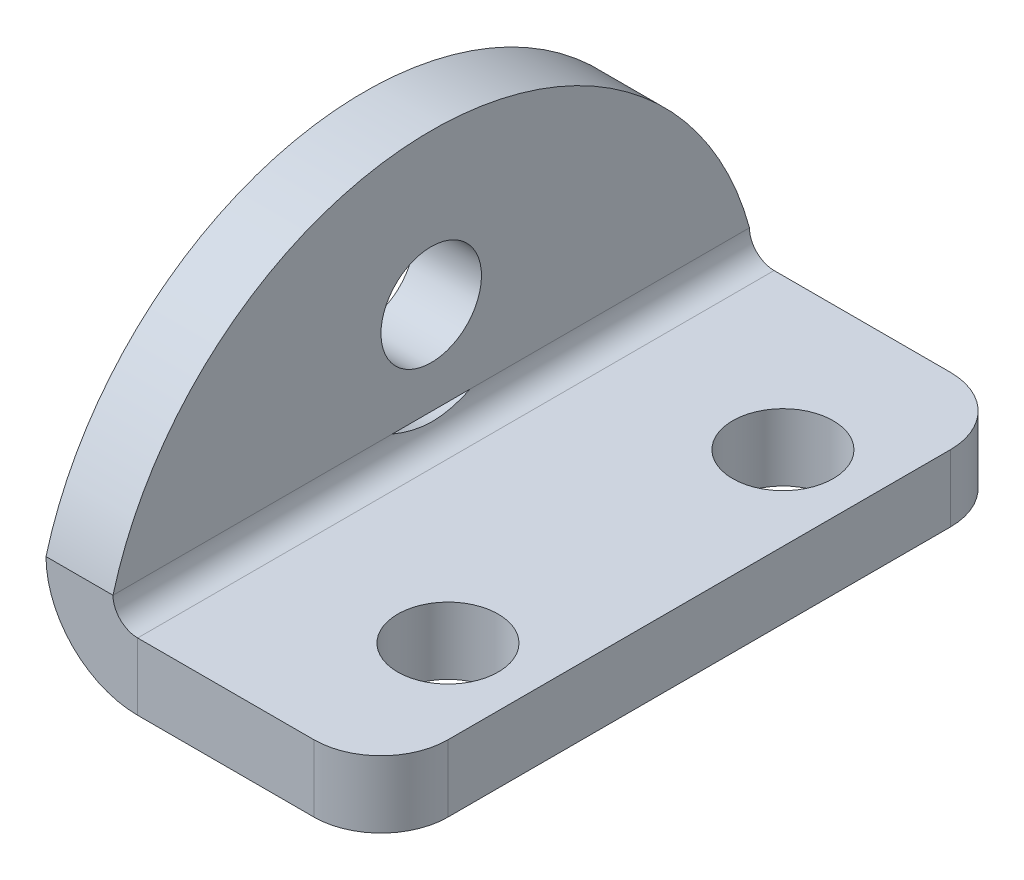
ISO-10303-21;
HEADER;
FILE_DESCRIPTION(('STEP AP214'),'2;1');
FILE_NAME('part.step','',(''),(''),'','','');
FILE_SCHEMA(('AUTOMOTIVE_DESIGN { 1 0 10303 214 1 1 1 1 }'));
ENDSEC;
DATA;
#1=APPLICATION_CONTEXT('core data for automotive mechanical design processes');
#2=APPLICATION_PROTOCOL_DEFINITION('international standard','automotive_design',2000,#1);
#3=PRODUCT_CONTEXT('',#1,'mechanical');
#4=PRODUCT('Part','Part','',(#3));
#5=PRODUCT_RELATED_PRODUCT_CATEGORY('part','',(#4));
#6=PRODUCT_DEFINITION_FORMATION('','',#4);
#7=PRODUCT_DEFINITION_CONTEXT('part definition',#1,'design');
#8=PRODUCT_DEFINITION('design','',#6,#7);
#9=PRODUCT_DEFINITION_SHAPE('','',#8);
#10=(LENGTH_UNIT() NAMED_UNIT(*) SI_UNIT(.MILLI.,.METRE.));
#11=(NAMED_UNIT(*) PLANE_ANGLE_UNIT() SI_UNIT($,.RADIAN.));
#12=(NAMED_UNIT(*) SI_UNIT($,.STERADIAN.) SOLID_ANGLE_UNIT());
#13=UNCERTAINTY_MEASURE_WITH_UNIT(LENGTH_MEASURE(1.E-05),#10,'distance_accuracy_value','');
#14=(GEOMETRIC_REPRESENTATION_CONTEXT(3) GLOBAL_UNCERTAINTY_ASSIGNED_CONTEXT((#13)) GLOBAL_UNIT_ASSIGNED_CONTEXT((#10,
#11,#12)) REPRESENTATION_CONTEXT('',''));
#15=CARTESIAN_POINT('',(0.,0.,0.));
#16=DIRECTION('',(0.,0.,1.));
#17=DIRECTION('',(1.,0.,0.));
#18=AXIS2_PLACEMENT_3D('',#15,#16,#17);
#19=CARTESIAN_POINT('',(-2.2634,2.7366,9.50000000000001));
#20=DIRECTION('',(0.,0.,1.));
#21=DIRECTION('',(-1.,0.,0.));
#22=AXIS2_PLACEMENT_3D('',#19,#20,#21);
#23=CYLINDRICAL_SURFACE('',#22,2.7366);
#24=DIRECTION('',(0.,0.,1.));
#25=VECTOR('',#24,1.);
#26=CARTESIAN_POINT('',(-5.,2.73659999999999,0.));
#27=LINE('',#26,#25);
#28=CARTESIAN_POINT('',(-5.00000000000001,2.73659999999999,1.16774159812862));
#29=VERTEX_POINT('',#28);
#30=CARTESIAN_POINT('',(-5.,2.73659999999999,9.50000000000001));
#31=VERTEX_POINT('',#30);
#32=EDGE_CURVE('E171',#29,#31,#27,.T.);
#33=ORIENTED_EDGE('',*,*,#32,.F.);
#34=CARTESIAN_POINT('',(-5.00000000000001,2.73659999999999,1.16774159812861));
#35=CARTESIAN_POINT('',(-5.00000615898902,2.69649689305336,1.14218917618634));
#36=CARTESIAN_POINT('',(-4.99911865967854,2.65682454026863,1.11594846334026));
#37=CARTESIAN_POINT('',(-4.99570471210985,2.5783868185934,1.06177665366012));
#38=CARTESIAN_POINT('',(-4.9931688577585,2.53962798613762,1.03383669491577));
#39=CARTESIAN_POINT('',(-4.98660255199089,2.46344324270168,0.976176803693671));
#40=CARTESIAN_POINT('',(-4.98256867355179,2.42602060539419,0.946452921889045));
#41=CARTESIAN_POINT('',(-4.97311383166036,2.35208683527608,0.884367117423284));
#42=CARTESIAN_POINT('',(-4.96766260284027,2.31561755919396,0.851959723185913));
#43=CARTESIAN_POINT('',(-4.95572998617742,2.2450548121454,0.784956708477393));
#44=CARTESIAN_POINT('',(-4.94925064166815,2.21095681773613,0.750365508648848));
#45=CARTESIAN_POINT('',(-4.93565039209359,2.14569870818548,0.678714373442843));
#46=CARTESIAN_POINT('',(-4.92853064820784,2.11453347728042,0.641658936836953));
#47=CARTESIAN_POINT('',(-4.91741556307644,2.06917577953861,0.582174801484713));
#48=CARTESIAN_POINT('',(-4.91346567259713,2.05368925642396,0.560722987419501));
#49=CARTESIAN_POINT('',(-4.90563491674935,2.02399194684682,0.516945719254943));
#50=CARTESIAN_POINT('',(-4.90175405486496,2.00978122463212,0.494620221239146));
#51=CARTESIAN_POINT('',(-4.89041584437556,1.9694350479766,0.426426311440523));
#52=CARTESIAN_POINT('',(-4.8832289436943,1.9454517819656,0.379169556825255));
#53=CARTESIAN_POINT('',(-4.87380450920717,1.91508611472057,0.305355282135582));
#54=CARTESIAN_POINT('',(-4.87087102225965,1.90584800627468,0.280046153734831));
#55=CARTESIAN_POINT('',(-4.86564467407732,1.88962120384771,0.228654714840166));
#56=CARTESIAN_POINT('',(-4.86335181944759,1.88263253305886,0.202572396377505));
#57=CARTESIAN_POINT('',(-4.85765052601997,1.86539229096047,0.123513659792868));
#58=CARTESIAN_POINT('',(-4.85539749881098,1.85879899430893,0.069566652845801));
#59=CARTESIAN_POINT('',(-4.85472155917105,1.85681089937765,-0.0319159771874186));
#60=CARTESIAN_POINT('',(-4.85586432400998,1.86014631523373,-0.0794296405144935));
#61=CARTESIAN_POINT('',(-4.8607755945893,1.87481323784478,-0.173084174789821));
#62=CARTESIAN_POINT('',(-4.86454759587894,1.8861553897488,-0.219223132827355));
#63=CARTESIAN_POINT('',(-4.87529544294472,1.9196768022703,-0.321337609071105));
#64=CARTESIAN_POINT('',(-4.88286630491078,1.94397532883149,-0.37653965688976));
#65=CARTESIAN_POINT('',(-4.89938409770296,2.00077471036077,-0.482331386179108));
#66=CARTESIAN_POINT('',(-4.90833455654978,2.03329673570811,-0.532908697124104));
#67=CARTESIAN_POINT('',(-4.92490638096064,2.09914620996682,-0.622604111272901));
#68=CARTESIAN_POINT('',(-4.93253247725038,2.13167467874297,-0.662320906426968));
#69=CARTESIAN_POINT('',(-4.94712386497936,2.20010199071878,-0.738901630014907));
#70=CARTESIAN_POINT('',(-4.95408860198255,2.23600361243824,-0.775763160112277));
#71=CARTESIAN_POINT('',(-4.96687661264682,2.31042787132398,-0.847013164932087));
#72=CARTESIAN_POINT('',(-4.9726986575737,2.34895327054079,-0.88139895261878));
#73=CARTESIAN_POINT('',(-4.98284472801234,2.42806895436103,-0.947947487824216));
#74=CARTESIAN_POINT('',(-4.98716853408566,2.4686595404429,-0.980109909147513));
#75=CARTESIAN_POINT('',(-4.99365731258998,2.54678207857721,-1.03889828726153));
#76=CARTESIAN_POINT('',(-4.99601162892588,2.5841382005171,-1.06573828348341));
#77=CARTESIAN_POINT('',(-4.99918160144093,2.65972866194703,-1.11784611715969));
#78=CARTESIAN_POINT('',(-5.00000465178601,2.69795787397342,-1.14312093702584));
#79=CARTESIAN_POINT('',(-5.00000000000001,2.73659999999999,-1.16774159812861));
#80=B_SPLINE_CURVE_WITH_KNOTS('',3,(#34,#35,#36,#37,#38,#39,#40,#41,#42,#43,#44,#45,#46,#47,#48,
#49,#50,#51,#52,#53,#54,#55,#56,#57,#58,#59,#60,#61,#62,#63,#64,#65,#66,#67,#68,#69,#70,#71,#72,
#73,#74,#75,#76,#77,#78,#79),.UNSPECIFIED.,.F.,.F.,(4,2,2,2,2,2,2,2,2,2,2,2,2,2,2,2,2,2,2,2,2,2,
4),(0.,0.142650584568858,0.286122415426842,0.429924508611129,0.577093535221466,0.7239736514356,
0.870592614397462,0.950803343300165,1.03101810925374,1.19079242476292,1.2719995589159,
1.35320753030686,1.51510978409041,1.65723119621429,1.79954191893003,1.98088958586272,
2.16270894947261,2.3181926151809,2.47380549726453,2.62958480364791,2.78538691649684,
2.9235032877244,3.06095097507903),.UNSPECIFIED.);
#81=CARTESIAN_POINT('',(-5.,2.73659999999999,-1.16774159812861));
#82=VERTEX_POINT('',#81);
#83=EDGE_CURVE('E155',#29,#82,#80,.T.);
#84=ORIENTED_EDGE('',*,*,#83,.T.);
#85=CARTESIAN_POINT('',(-4.99999999999996,2.73659999999999,-9.49999999999999));
#86=VERTEX_POINT('',#85);
#87=EDGE_CURVE('E178',#86,#82,#27,.T.);
#88=ORIENTED_EDGE('',*,*,#87,.F.);
#89=CARTESIAN_POINT('',(-2.2634,2.7366,-9.49999999999999));
#90=DIRECTION('',(0.,0.,1.));
#91=DIRECTION('',(1.,0.,0.));
#92=AXIS2_PLACEMENT_3D('',#89,#90,#91);
#93=CIRCLE('',#92,2.7366);
#94=CARTESIAN_POINT('',(-2.2634,0.,-9.49999999999999));
#95=VERTEX_POINT('',#94);
#96=EDGE_CURVE('E327',#95,#86,#93,.F.);
#97=ORIENTED_EDGE('',*,*,#96,.F.);
#98=DIRECTION('',(0.,0.,1.));
#99=VECTOR('',#98,1.);
#100=CARTESIAN_POINT('',(-2.2634,0.,9.50000000000001));
#101=LINE('',#100,#99);
#102=CARTESIAN_POINT('',(-2.2634,0.,9.50000000000001));
#103=VERTEX_POINT('',#102);
#104=EDGE_CURVE('E340',#103,#95,#101,.F.);
#105=ORIENTED_EDGE('',*,*,#104,.F.);
#106=CARTESIAN_POINT('',(-2.2634,2.7366,9.50000000000001));
#107=DIRECTION('',(0.,0.,1.));
#108=DIRECTION('',(1.,0.,0.));
#109=AXIS2_PLACEMENT_3D('',#106,#107,#108);
#110=CIRCLE('',#109,2.7366);
#111=EDGE_CURVE('E174',#31,#103,#110,.T.);
#112=ORIENTED_EDGE('',*,*,#111,.F.);
#113=EDGE_LOOP('',(#33,#84,#88,#97,#105,#112));
#114=FACE_BOUND('',#113,.T.);
#115=ADVANCED_FACE('F82',(#114),#23,.T.);
#116=CARTESIAN_POINT('',(-2.2634,2.7366,9.50000000000001));
#117=DIRECTION('',(0.,0.,1.));
#118=DIRECTION('',(-1.,0.,0.));
#119=AXIS2_PLACEMENT_3D('',#116,#117,#118);
#120=CYLINDRICAL_SURFACE('',#119,0.736600000000002);
#121=CARTESIAN_POINT('',(-3.00000000000001,2.7366,1.16774159812861));
#122=CARTESIAN_POINT('',(-2.99998441217816,2.71516895489776,1.11705267967524));
#123=CARTESIAN_POINT('',(-2.99906509328307,2.695143041152,1.0657872094659));
#124=CARTESIAN_POINT('',(-2.99603130552345,2.65795732074591,0.962270375161626));
#125=CARTESIAN_POINT('',(-2.99391706206043,2.64079697433728,0.910019198799135));
#126=CARTESIAN_POINT('',(-2.98910504181403,2.60938862273194,0.804673934119674));
#127=CARTESIAN_POINT('',(-2.98640720974152,2.59514089372514,0.751579766379735));
#128=CARTESIAN_POINT('',(-2.98093556718995,2.56958747497536,0.644746192646869));
#129=CARTESIAN_POINT('',(-2.97816183247633,2.55827896180229,0.591007458143509));
#130=CARTESIAN_POINT('',(-2.97296900262052,2.53862340043193,0.482978371404042));
#131=CARTESIAN_POINT('',(-2.97054987310082,2.53027606504917,0.428688073186136));
#132=CARTESIAN_POINT('',(-2.96640969770018,2.51658108601013,0.319707332912877));
#133=CARTESIAN_POINT('',(-2.96468859707619,2.5112332071083,0.265016922578996));
#134=CARTESIAN_POINT('',(-2.96215480544548,2.50349464054842,0.15482215147417));
#135=CARTESIAN_POINT('',(-2.96135193702421,2.50113590020235,0.0993153078652758));
#136=CARTESIAN_POINT('',(-2.96080152177807,2.49951043615663,-0.0117562927726504));
#137=CARTESIAN_POINT('',(-2.96105410829999,2.50024410315365,-0.0673210562326685));
#138=CARTESIAN_POINT('',(-2.96257909550629,2.50479434274661,-0.178313645484042));
#139=CARTESIAN_POINT('',(-2.96385157367967,2.5086111495925,-0.23374146054939));
#140=CARTESIAN_POINT('',(-2.96724102332427,2.51930181627391,-0.344201722012943));
#141=CARTESIAN_POINT('',(-2.96935690531469,2.52617173351435,-0.399234585593777));
#142=CARTESIAN_POINT('',(-2.97414018216184,2.54293965954802,-0.508806940880149));
#143=CARTESIAN_POINT('',(-2.97680751789144,2.5528373437572,-0.563346484825826));
#144=CARTESIAN_POINT('',(-2.98229916083286,2.57566595004365,-0.671754486032218));
#145=CARTESIAN_POINT('',(-2.98512340925252,2.58859574181963,-0.725623185507378));
#146=CARTESIAN_POINT('',(-2.99107271374134,2.62081806680127,-0.845306721273341));
#147=CARTESIAN_POINT('',(-2.99410973556568,2.64089246594989,-0.910917994461802));
#148=CARTESIAN_POINT('',(-2.99855250242541,2.68545322811799,-1.04056134817595));
#149=CARTESIAN_POINT('',(-2.99996078767487,2.709932651859,-1.10459573495459));
#150=CARTESIAN_POINT('',(-3.00000000000001,2.7366,-1.16774159812861));
#151=B_SPLINE_CURVE_WITH_KNOTS('',3,(#121,#122,#123,#124,#125,#126,#127,#128,#129,#130,#131,
#132,#133,#134,#135,#136,#137,#138,#139,#140,#141,#142,#143,#144,#145,#146,#147,#148,#149,#150),
.UNSPECIFIED.,.F.,.F.,(4,2,2,2,2,2,2,2,2,2,2,2,2,2,4),(0.,0.165049478759455,0.330067834221652,
0.495101830353322,0.659976702875656,0.82483558087712,0.989681527287898,1.15627485131263,
1.32288922347285,1.48951625580558,1.65592873886026,1.8223233883356,1.98865610796605,
2.19452013452952,2.40006265611657),.UNSPECIFIED.);
#152=CARTESIAN_POINT('',(-3.,2.7366,1.16774159812861));
#153=VERTEX_POINT('',#152);
#154=CARTESIAN_POINT('',(-3.,2.7366,-1.16774159812861));
#155=VERTEX_POINT('',#154);
#156=EDGE_CURVE('E182',#153,#155,#151,.T.);
#157=ORIENTED_EDGE('',*,*,#156,.F.);
#158=DIRECTION('',(0.,0.,-1.));
#159=VECTOR('',#158,1.);
#160=CARTESIAN_POINT('',(-3.00000000000001,2.7366,-9.49999999999999));
#161=LINE('',#160,#159);
#162=CARTESIAN_POINT('',(-3.,2.7366,9.50000000000001));
#163=VERTEX_POINT('',#162);
#164=EDGE_CURVE('E348',#153,#163,#161,.F.);
#165=ORIENTED_EDGE('',*,*,#164,.T.);
#166=CARTESIAN_POINT('',(-2.2634,2.7366,9.50000000000001));
#167=DIRECTION('',(0.,0.,1.));
#168=DIRECTION('',(1.,0.,0.));
#169=AXIS2_PLACEMENT_3D('',#166,#167,#168);
#170=CIRCLE('',#169,0.736600000000002);
#171=CARTESIAN_POINT('',(-2.2634,2.,9.50000000000001));
#172=VERTEX_POINT('',#171);
#173=EDGE_CURVE('E330',#163,#172,#170,.T.);
#174=ORIENTED_EDGE('',*,*,#173,.T.);
#175=DIRECTION('',(0.,0.,1.));
#176=VECTOR('',#175,1.);
#177=CARTESIAN_POINT('',(-2.2634,2.,9.50000000000001));
#178=LINE('',#177,#176);
#179=CARTESIAN_POINT('',(-2.2634,2.,-9.49999999999999));
#180=VERTEX_POINT('',#179);
#181=EDGE_CURVE('E333',#172,#180,#178,.F.);
#182=ORIENTED_EDGE('',*,*,#181,.T.);
#183=CARTESIAN_POINT('',(-2.2634,2.7366,-9.49999999999999));
#184=DIRECTION('',(0.,0.,1.));
#185=DIRECTION('',(1.,0.,0.));
#186=AXIS2_PLACEMENT_3D('',#183,#184,#185);
#187=CIRCLE('',#186,0.736600000000002);
#188=CARTESIAN_POINT('',(-3.00000000000001,2.7366,-9.49999999999999));
#189=VERTEX_POINT('',#188);
#190=EDGE_CURVE('E336',#180,#189,#187,.F.);
#191=ORIENTED_EDGE('',*,*,#190,.T.);
#192=EDGE_CURVE('E350',#189,#155,#161,.F.);
#193=ORIENTED_EDGE('',*,*,#192,.T.);
#194=EDGE_LOOP('',(#157,#165,#174,#182,#191,#193));
#195=FACE_BOUND('',#194,.T.);
#196=ADVANCED_FACE('F226',(#195),#120,.F.);
#197=CARTESIAN_POINT('',(-4.99999999999999,0.,0.));
#198=DIRECTION('',(-1.,0.,0.));
#199=DIRECTION('',(0.,-1.,0.));
#200=AXIS2_PLACEMENT_3D('',#197,#198,#199);
#201=PLANE('',#200);
#202=CARTESIAN_POINT('',(-5.00000000000001,5.5,0.));
#203=DIRECTION('',(-1.,0.,0.));
#204=DIRECTION('',(0.,-1.,0.));
#205=AXIS2_PLACEMENT_3D('',#202,#203,#204);
#206=CIRCLE('',#205,1.5);
#207=CARTESIAN_POINT('',(-5.00000000000001,3.99999999999999,0.));
#208=VERTEX_POINT('',#207);
#209=EDGE_CURVE('E187',#208,#208,#206,.F.);
#210=ORIENTED_EDGE('',*,*,#209,.T.);
#211=EDGE_LOOP('',(#210));
#212=FACE_BOUND('',#211,.T.);
#213=CARTESIAN_POINT('',(-4.99999999999999,0.155644769667096,0.));
#214=DIRECTION('',(-1.,0.,0.));
#215=DIRECTION('',(0.,-1.,0.));
#216=AXIS2_PLACEMENT_3D('',#213,#214,#215);
#217=CIRCLE('',#216,9.8443552303329);
#218=EDGE_CURVE('E349',#31,#86,#217,.T.);
#219=ORIENTED_EDGE('',*,*,#218,.T.);
#220=ORIENTED_EDGE('',*,*,#87,.T.);
#221=DIRECTION('',(0.,0.,1.));
#222=VECTOR('',#221,1.);
#223=CARTESIAN_POINT('',(-5.00000000000001,2.73659999999999,9.50000000000001));
#224=LINE('',#223,#222);
#225=EDGE_CURVE('E161',#29,#82,#224,.F.);
#226=ORIENTED_EDGE('',*,*,#225,.F.);
#227=ORIENTED_EDGE('',*,*,#32,.T.);
#228=EDGE_LOOP('',(#219,#220,#226,#227));
#229=FACE_BOUND('',#228,.T.);
#230=ADVANCED_FACE('F181',(#212,#229),#201,.T.);
#231=CARTESIAN_POINT('',(-2.99999999999999,0.,0.));
#232=DIRECTION('',(-1.,0.,0.));
#233=DIRECTION('',(0.,-1.,0.));
#234=AXIS2_PLACEMENT_3D('',#231,#232,#233);
#235=PLANE('',#234);
#236=CARTESIAN_POINT('',(-3.00000000000001,5.5,0.));
#237=DIRECTION('',(1.,0.,0.));
#238=DIRECTION('',(0.,1.,0.));
#239=AXIS2_PLACEMENT_3D('',#236,#237,#238);
#240=CIRCLE('',#239,1.5);
#241=CARTESIAN_POINT('',(-3.00000000000002,7.,0.));
#242=VERTEX_POINT('',#241);
#243=EDGE_CURVE('E357',#242,#242,#240,.T.);
#244=ORIENTED_EDGE('',*,*,#243,.F.);
#245=EDGE_LOOP('',(#244));
#246=FACE_BOUND('',#245,.T.);
#247=ORIENTED_EDGE('',*,*,#192,.F.);
#248=CARTESIAN_POINT('',(-2.99999999999999,0.155644769667103,0.));
#249=DIRECTION('',(1.,0.,0.));
#250=DIRECTION('',(0.,1.,0.));
#251=AXIS2_PLACEMENT_3D('',#248,#249,#250);
#252=CIRCLE('',#251,9.8443552303329);
#253=EDGE_CURVE('E355',#163,#189,#252,.F.);
#254=ORIENTED_EDGE('',*,*,#253,.F.);
#255=ORIENTED_EDGE('',*,*,#164,.F.);
#256=DIRECTION('',(0.,0.,1.));
#257=VECTOR('',#256,1.);
#258=CARTESIAN_POINT('',(-3.,2.7366,9.50000000000001));
#259=LINE('',#258,#257);
#260=EDGE_CURVE('E167',#153,#155,#259,.F.);
#261=ORIENTED_EDGE('',*,*,#260,.T.);
#262=EDGE_LOOP('',(#247,#254,#255,#261));
#263=FACE_BOUND('',#262,.T.);
#264=ADVANCED_FACE('F225',(#246,#263),#235,.F.);
#265=CARTESIAN_POINT('',(-5.,2.,-9.49999999999999));
#266=DIRECTION('',(0.,0.,1.));
#267=DIRECTION('',(1.,0.,0.));
#268=AXIS2_PLACEMENT_3D('',#265,#266,#267);
#269=PLANE('',#268);
#270=DIRECTION('',(-1.,0.,0.));
#271=VECTOR('',#270,1.);
#272=CARTESIAN_POINT('',(-5.,2.,-9.49999999999999));
#273=LINE('',#272,#271);
#274=CARTESIAN_POINT('',(3.,2.,-9.49999999999999));
#275=VERTEX_POINT('',#274);
#276=EDGE_CURVE('E310',#275,#180,#273,.T.);
#277=ORIENTED_EDGE('',*,*,#276,.F.);
#278=DIRECTION('',(0.,-1.,0.));
#279=VECTOR('',#278,1.);
#280=CARTESIAN_POINT('',(3.,2.,-9.49999999999999));
#281=LINE('',#280,#279);
#282=CARTESIAN_POINT('',(3.,0.,-9.49999999999999));
#283=VERTEX_POINT('',#282);
#284=EDGE_CURVE('E281',#275,#283,#281,.T.);
#285=ORIENTED_EDGE('',*,*,#284,.T.);
#286=DIRECTION('',(-1.,0.,0.));
#287=VECTOR('',#286,1.);
#288=CARTESIAN_POINT('',(-5.,0.,-9.49999999999999));
#289=LINE('',#288,#287);
#290=EDGE_CURVE('E302',#283,#95,#289,.T.);
#291=ORIENTED_EDGE('',*,*,#290,.T.);
#292=DIRECTION('',(0.,-1.,0.));
#293=VECTOR('',#292,1.);
#294=CARTESIAN_POINT('',(-2.2634,2.,-9.49999999999999));
#295=LINE('',#294,#293);
#296=EDGE_CURVE('E320',#180,#95,#295,.T.);
#297=ORIENTED_EDGE('',*,*,#296,.F.);
#298=EDGE_LOOP('',(#277,#285,#291,#297));
#299=FACE_BOUND('',#298,.T.);
#300=ADVANCED_FACE('F230',(#299),#269,.F.);
#301=CARTESIAN_POINT('',(-5.,2.,9.50000000000001));
#302=DIRECTION('',(0.,0.,-1.));
#303=DIRECTION('',(-1.,0.,0.));
#304=AXIS2_PLACEMENT_3D('',#301,#302,#303);
#305=PLANE('',#304);
#306=DIRECTION('',(1.,0.,0.));
#307=VECTOR('',#306,1.);
#308=CARTESIAN_POINT('',(-5.,0.,9.50000000000001));
#309=LINE('',#308,#307);
#310=CARTESIAN_POINT('',(3.,0.,9.50000000000001));
#311=VERTEX_POINT('',#310);
#312=EDGE_CURVE('E298',#103,#311,#309,.T.);
#313=ORIENTED_EDGE('',*,*,#312,.T.);
#314=DIRECTION('',(0.,-1.,0.));
#315=VECTOR('',#314,1.);
#316=CARTESIAN_POINT('',(3.,2.,9.50000000000001));
#317=LINE('',#316,#315);
#318=CARTESIAN_POINT('',(3.,2.,9.50000000000001));
#319=VERTEX_POINT('',#318);
#320=EDGE_CURVE('E13',#311,#319,#317,.F.);
#321=ORIENTED_EDGE('',*,*,#320,.T.);
#322=DIRECTION('',(1.,0.,0.));
#323=VECTOR('',#322,1.);
#324=CARTESIAN_POINT('',(-5.,2.,9.50000000000001));
#325=LINE('',#324,#323);
#326=EDGE_CURVE('E297',#172,#319,#325,.T.);
#327=ORIENTED_EDGE('',*,*,#326,.F.);
#328=DIRECTION('',(0.,-1.,0.));
#329=VECTOR('',#328,1.);
#330=CARTESIAN_POINT('',(-2.2634,2.,9.50000000000001));
#331=LINE('',#330,#329);
#332=EDGE_CURVE('E325',#172,#103,#331,.T.);
#333=ORIENTED_EDGE('',*,*,#332,.T.);
#334=EDGE_LOOP('',(#313,#321,#327,#333));
#335=FACE_BOUND('',#334,.T.);
#336=ADVANCED_FACE('F257',(#335),#305,.F.);
#337=CARTESIAN_POINT('',(0.,2.,0.));
#338=DIRECTION('',(0.,1.,0.));
#339=DIRECTION('',(0.,0.,1.));
#340=AXIS2_PLACEMENT_3D('',#337,#338,#339);
#341=PLANE('',#340);
#342=CARTESIAN_POINT('',(2.5,2.,-5.));
#343=DIRECTION('',(0.,1.,0.));
#344=DIRECTION('',(0.,0.,1.));
#345=AXIS2_PLACEMENT_3D('',#342,#343,#344);
#346=CIRCLE('',#345,1.5);
#347=CARTESIAN_POINT('',(2.5,2.,-3.5));
#348=VERTEX_POINT('',#347);
#349=EDGE_CURVE('E316',#348,#348,#346,.T.);
#350=ORIENTED_EDGE('',*,*,#349,.F.);
#351=EDGE_LOOP('',(#350));
#352=FACE_BOUND('',#351,.T.);
#353=CARTESIAN_POINT('',(2.5,2.,5.));
#354=DIRECTION('',(0.,1.,0.));
#355=DIRECTION('',(0.,0.,1.));
#356=AXIS2_PLACEMENT_3D('',#353,#354,#355);
#357=CIRCLE('',#356,1.5);
#358=CARTESIAN_POINT('',(2.5,2.,6.5));
#359=VERTEX_POINT('',#358);
#360=EDGE_CURVE('E313',#359,#359,#357,.T.);
#361=ORIENTED_EDGE('',*,*,#360,.F.);
#362=EDGE_LOOP('',(#361));
#363=FACE_BOUND('',#362,.T.);
#364=DIRECTION('',(0.,0.,-1.));
#365=VECTOR('',#364,1.);
#366=CARTESIAN_POINT('',(5.,2.,-9.49999999999999));
#367=LINE('',#366,#365);
#368=CARTESIAN_POINT('',(5.,2.,7.50000000000001));
#369=VERTEX_POINT('',#368);
#370=CARTESIAN_POINT('',(5.,2.,-7.49999999999999));
#371=VERTEX_POINT('',#370);
#372=EDGE_CURVE('E301',#369,#371,#367,.T.);
#373=ORIENTED_EDGE('',*,*,#372,.T.);
#374=CARTESIAN_POINT('',(3.,2.,-7.49999999999999));
#375=DIRECTION('',(0.,1.,0.));
#376=DIRECTION('',(0.,0.,1.));
#377=AXIS2_PLACEMENT_3D('',#374,#375,#376);
#378=CIRCLE('',#377,2.);
#379=EDGE_CURVE('E90',#371,#275,#378,.T.);
#380=ORIENTED_EDGE('',*,*,#379,.T.);
#381=ORIENTED_EDGE('',*,*,#276,.T.);
#382=ORIENTED_EDGE('',*,*,#181,.F.);
#383=ORIENTED_EDGE('',*,*,#326,.T.);
#384=CARTESIAN_POINT('',(3.,2.,7.50000000000001));
#385=DIRECTION('',(0.,1.,0.));
#386=DIRECTION('',(0.,0.,1.));
#387=AXIS2_PLACEMENT_3D('',#384,#385,#386);
#388=CIRCLE('',#387,2.);
#389=EDGE_CURVE('E285',#319,#369,#388,.T.);
#390=ORIENTED_EDGE('',*,*,#389,.T.);
#391=EDGE_LOOP('',(#373,#380,#381,#382,#383,#390));
#392=FACE_BOUND('',#391,.T.);
#393=ADVANCED_FACE('F253',(#352,#363,#392),#341,.T.);
#394=CARTESIAN_POINT('',(0.,0.,0.));
#395=DIRECTION('',(0.,1.,0.));
#396=DIRECTION('',(0.,0.,1.));
#397=AXIS2_PLACEMENT_3D('',#394,#395,#396);
#398=PLANE('',#397);
#399=CARTESIAN_POINT('',(2.5,0.,5.));
#400=DIRECTION('',(0.,1.,0.));
#401=DIRECTION('',(0.,0.,1.));
#402=AXIS2_PLACEMENT_3D('',#399,#400,#401);
#403=CIRCLE('',#402,1.5);
#404=CARTESIAN_POINT('',(2.5,0.,6.5));
#405=VERTEX_POINT('',#404);
#406=EDGE_CURVE('E317',#405,#405,#403,.F.);
#407=ORIENTED_EDGE('',*,*,#406,.F.);
#408=EDGE_LOOP('',(#407));
#409=FACE_BOUND('',#408,.T.);
#410=CARTESIAN_POINT('',(2.5,0.,-5.));
#411=DIRECTION('',(0.,1.,0.));
#412=DIRECTION('',(0.,0.,1.));
#413=AXIS2_PLACEMENT_3D('',#410,#411,#412);
#414=CIRCLE('',#413,1.5);
#415=CARTESIAN_POINT('',(2.5,0.,-3.5));
#416=VERTEX_POINT('',#415);
#417=EDGE_CURVE('E307',#416,#416,#414,.F.);
#418=ORIENTED_EDGE('',*,*,#417,.F.);
#419=EDGE_LOOP('',(#418));
#420=FACE_BOUND('',#419,.T.);
#421=ORIENTED_EDGE('',*,*,#290,.F.);
#422=CARTESIAN_POINT('',(3.,0.,-7.49999999999999));
#423=DIRECTION('',(0.,1.,0.));
#424=DIRECTION('',(0.,0.,1.));
#425=AXIS2_PLACEMENT_3D('',#422,#423,#424);
#426=CIRCLE('',#425,2.);
#427=CARTESIAN_POINT('',(5.,0.,-7.49999999999999));
#428=VERTEX_POINT('',#427);
#429=EDGE_CURVE('E292',#283,#428,#426,.F.);
#430=ORIENTED_EDGE('',*,*,#429,.T.);
#431=DIRECTION('',(0.,0.,-1.));
#432=VECTOR('',#431,1.);
#433=CARTESIAN_POINT('',(5.,0.,-9.49999999999999));
#434=LINE('',#433,#432);
#435=CARTESIAN_POINT('',(5.,0.,7.50000000000001));
#436=VERTEX_POINT('',#435);
#437=EDGE_CURVE('E304',#436,#428,#434,.T.);
#438=ORIENTED_EDGE('',*,*,#437,.F.);
#439=CARTESIAN_POINT('',(3.,0.,7.50000000000001));
#440=DIRECTION('',(0.,1.,0.));
#441=DIRECTION('',(0.,0.,1.));
#442=AXIS2_PLACEMENT_3D('',#439,#440,#441);
#443=CIRCLE('',#442,2.);
#444=EDGE_CURVE('E294',#436,#311,#443,.F.);
#445=ORIENTED_EDGE('',*,*,#444,.T.);
#446=ORIENTED_EDGE('',*,*,#312,.F.);
#447=ORIENTED_EDGE('',*,*,#104,.T.);
#448=EDGE_LOOP('',(#421,#430,#438,#445,#446,#447));
#449=FACE_BOUND('',#448,.T.);
#450=ADVANCED_FACE('F256',(#409,#420,#449),#398,.F.);
#451=CARTESIAN_POINT('',(5.,2.,-9.49999999999999));
#452=DIRECTION('',(-1.,0.,0.));
#453=DIRECTION('',(0.,0.,1.));
#454=AXIS2_PLACEMENT_3D('',#451,#452,#453);
#455=PLANE('',#454);
#456=ORIENTED_EDGE('',*,*,#437,.T.);
#457=DIRECTION('',(0.,-1.,0.));
#458=VECTOR('',#457,1.);
#459=CARTESIAN_POINT('',(5.,2.,-7.49999999999999));
#460=LINE('',#459,#458);
#461=EDGE_CURVE('E279',#428,#371,#460,.F.);
#462=ORIENTED_EDGE('',*,*,#461,.T.);
#463=ORIENTED_EDGE('',*,*,#372,.F.);
#464=DIRECTION('',(0.,-1.,0.));
#465=VECTOR('',#464,1.);
#466=CARTESIAN_POINT('',(5.,2.,7.50000000000001));
#467=LINE('',#466,#465);
#468=EDGE_CURVE('E289',#369,#436,#467,.T.);
#469=ORIENTED_EDGE('',*,*,#468,.T.);
#470=EDGE_LOOP('',(#456,#462,#463,#469));
#471=FACE_BOUND('',#470,.T.);
#472=ADVANCED_FACE('F251',(#471),#455,.F.);
#473=CARTESIAN_POINT('',(2.5,-0.00100000000000013,5.));
#474=DIRECTION('',(0.,1.,0.));
#475=DIRECTION('',(0.,0.,1.));
#476=AXIS2_PLACEMENT_3D('',#473,#474,#475);
#477=CYLINDRICAL_SURFACE('',#476,1.5);
#478=ORIENTED_EDGE('',*,*,#360,.T.);
#479=EDGE_LOOP('',(#478));
#480=FACE_BOUND('',#479,.T.);
#481=ORIENTED_EDGE('',*,*,#406,.T.);
#482=EDGE_LOOP('',(#481));
#483=FACE_BOUND('',#482,.T.);
#484=ADVANCED_FACE('F247',(#480,#483),#477,.F.);
#485=CARTESIAN_POINT('',(2.5,-0.00100000000000013,-5.));
#486=DIRECTION('',(0.,1.,0.));
#487=DIRECTION('',(0.,0.,1.));
#488=AXIS2_PLACEMENT_3D('',#485,#486,#487);
#489=CYLINDRICAL_SURFACE('',#488,1.5);
#490=ORIENTED_EDGE('',*,*,#349,.T.);
#491=EDGE_LOOP('',(#490));
#492=FACE_BOUND('',#491,.T.);
#493=ORIENTED_EDGE('',*,*,#417,.T.);
#494=EDGE_LOOP('',(#493));
#495=FACE_BOUND('',#494,.T.);
#496=ADVANCED_FACE('F240',(#492,#495),#489,.F.);
#497=CARTESIAN_POINT('',(-2.2634,2.7366,-9.49999999999999));
#498=DIRECTION('',(0.,0.,-1.));
#499=DIRECTION('',(-1.,0.,0.));
#500=AXIS2_PLACEMENT_3D('',#497,#498,#499);
#501=PLANE('',#500);
#502=DIRECTION('',(-1.,0.,0.));
#503=VECTOR('',#502,1.);
#504=CARTESIAN_POINT('',(-5.00000000000001,2.73659999999999,-9.49999999999999));
#505=LINE('',#504,#503);
#506=EDGE_CURVE('E345',#189,#86,#505,.T.);
#507=ORIENTED_EDGE('',*,*,#506,.F.);
#508=ORIENTED_EDGE('',*,*,#190,.F.);
#509=ORIENTED_EDGE('',*,*,#296,.T.);
#510=ORIENTED_EDGE('',*,*,#96,.T.);
#511=EDGE_LOOP('',(#507,#508,#509,#510));
#512=FACE_BOUND('',#511,.T.);
#513=ADVANCED_FACE('F237',(#512),#501,.T.);
#514=CARTESIAN_POINT('',(-2.2634,2.7366,9.50000000000001));
#515=DIRECTION('',(0.,0.,-1.));
#516=DIRECTION('',(-1.,0.,0.));
#517=AXIS2_PLACEMENT_3D('',#514,#515,#516);
#518=PLANE('',#517);
#519=ORIENTED_EDGE('',*,*,#173,.F.);
#520=DIRECTION('',(-1.,0.,0.));
#521=VECTOR('',#520,1.);
#522=CARTESIAN_POINT('',(-3.,2.7366,9.50000000000001));
#523=LINE('',#522,#521);
#524=EDGE_CURVE('E179',#163,#31,#523,.T.);
#525=ORIENTED_EDGE('',*,*,#524,.T.);
#526=ORIENTED_EDGE('',*,*,#111,.T.);
#527=ORIENTED_EDGE('',*,*,#332,.F.);
#528=EDGE_LOOP('',(#519,#525,#526,#527));
#529=FACE_BOUND('',#528,.T.);
#530=ADVANCED_FACE('F221',(#529),#518,.F.);
#531=CARTESIAN_POINT('',(-5.00100000000003,0.155644769667096,0.));
#532=DIRECTION('',(1.,0.,0.));
#533=DIRECTION('',(0.,1.,0.));
#534=AXIS2_PLACEMENT_3D('',#531,#532,#533);
#535=CYLINDRICAL_SURFACE('',#534,9.8443552303329);
#536=ORIENTED_EDGE('',*,*,#524,.F.);
#537=ORIENTED_EDGE('',*,*,#253,.T.);
#538=ORIENTED_EDGE('',*,*,#506,.T.);
#539=ORIENTED_EDGE('',*,*,#218,.F.);
#540=EDGE_LOOP('',(#536,#537,#538,#539));
#541=FACE_BOUND('',#540,.T.);
#542=ADVANCED_FACE('F217',(#541),#535,.T.);
#543=CARTESIAN_POINT('',(-5.00100000000005,5.5,0.));
#544=DIRECTION('',(1.,0.,0.));
#545=DIRECTION('',(0.,1.,0.));
#546=AXIS2_PLACEMENT_3D('',#543,#544,#545);
#547=CYLINDRICAL_SURFACE('',#546,1.5);
#548=ORIENTED_EDGE('',*,*,#209,.F.);
#549=EDGE_LOOP('',(#548));
#550=FACE_BOUND('',#549,.T.);
#551=ORIENTED_EDGE('',*,*,#243,.T.);
#552=EDGE_LOOP('',(#551));
#553=FACE_BOUND('',#552,.T.);
#554=ADVANCED_FACE('F207',(#550,#553),#547,.F.);
#555=CARTESIAN_POINT('',(3.,2.,-7.49999999999999));
#556=DIRECTION('',(0.,-1.,0.));
#557=DIRECTION('',(0.,0.,-1.));
#558=AXIS2_PLACEMENT_3D('',#555,#556,#557);
#559=CYLINDRICAL_SURFACE('',#558,2.);
#560=ORIENTED_EDGE('',*,*,#379,.F.);
#561=ORIENTED_EDGE('',*,*,#461,.F.);
#562=ORIENTED_EDGE('',*,*,#429,.F.);
#563=ORIENTED_EDGE('',*,*,#284,.F.);
#564=EDGE_LOOP('',(#560,#561,#562,#563));
#565=FACE_BOUND('',#564,.T.);
#566=ADVANCED_FACE('F216',(#565),#559,.T.);
#567=CARTESIAN_POINT('',(3.,2.,7.50000000000001));
#568=DIRECTION('',(0.,-1.,0.));
#569=DIRECTION('',(0.,0.,-1.));
#570=AXIS2_PLACEMENT_3D('',#567,#568,#569);
#571=CYLINDRICAL_SURFACE('',#570,2.);
#572=ORIENTED_EDGE('',*,*,#389,.F.);
#573=ORIENTED_EDGE('',*,*,#320,.F.);
#574=ORIENTED_EDGE('',*,*,#444,.F.);
#575=ORIENTED_EDGE('',*,*,#468,.F.);
#576=EDGE_LOOP('',(#572,#573,#574,#575));
#577=FACE_BOUND('',#576,.T.);
#578=ADVANCED_FACE('F84',(#577),#571,.T.);
#579=CARTESIAN_POINT('',(-3.,2.7366,0.));
#580=DIRECTION('',(0.,-1.,0.));
#581=DIRECTION('',(0.,0.,1.));
#582=AXIS2_PLACEMENT_3D('',#579,#580,#581);
#583=PLANE('',#582);
#584=DIRECTION('',(-1.,0.,0.));
#585=VECTOR('',#584,1.);
#586=CARTESIAN_POINT('',(-3.,2.7366,-1.16774159812861));
#587=LINE('',#586,#585);
#588=EDGE_CURVE('E97',#155,#82,#587,.T.);
#589=ORIENTED_EDGE('',*,*,#588,.F.);
#590=ORIENTED_EDGE('',*,*,#260,.F.);
#591=DIRECTION('',(-1.,0.,0.));
#592=VECTOR('',#591,1.);
#593=CARTESIAN_POINT('',(-3.,2.7366,1.16774159812862));
#594=LINE('',#593,#592);
#595=EDGE_CURVE('E102',#153,#29,#594,.T.);
#596=ORIENTED_EDGE('',*,*,#595,.T.);
#597=ORIENTED_EDGE('',*,*,#225,.T.);
#598=EDGE_LOOP('',(#589,#590,#596,#597));
#599=FACE_BOUND('',#598,.T.);
#600=ADVANCED_FACE('F164',(#599),#583,.T.);
#601=CARTESIAN_POINT('',(-2.9798,2.7366,1.16774159812861));
#602=CARTESIAN_POINT('',(-2.9798,2.66019243034756,0.981832290087788));
#603=CARTESIAN_POINT('',(-2.96839210117322,2.60323921578079,0.791534723795051));
#604=CARTESIAN_POINT('',(-2.95413673978602,2.54553923301514,0.499186504214743));
#605=CARTESIAN_POINT('',(-2.94973086262962,2.53096893393699,0.400575742243809));
#606=CARTESIAN_POINT('',(-2.94356185169557,2.51140221176445,0.200893887536502));
#607=CARTESIAN_POINT('',(-2.9418385057644,2.50649099560434,0.0999322822502521));
#608=CARTESIAN_POINT('',(-2.94183581678515,2.50648306769334,-0.199619655198932));
#609=CARTESIAN_POINT('',(-2.94918450369753,2.52567162015527,-0.397227198188433));
#610=CARTESIAN_POINT('',(-2.96822606507286,2.60239349892984,-0.78852121650216));
#611=CARTESIAN_POINT('',(-2.9798,2.66055855746226,-0.982714070907177));
#612=CARTESIAN_POINT('',(-2.9798,2.7366,-1.16774159812861));
#613=CARTESIAN_POINT('',(-3.00000000000001,2.7366,1.16774159812861));
#614=CARTESIAN_POINT('',(-3.,2.65804005752462,0.98183356386457));
#615=CARTESIAN_POINT('',(-2.98827043791764,2.59947890332793,0.791534723795051));
#616=CARTESIAN_POINT('',(-2.97361312468785,2.54015198079139,0.499186504214743));
#617=CARTESIAN_POINT('',(-2.96908301704771,2.52517084971801,0.400575742243809));
#618=CARTESIAN_POINT('',(-2.96274006136091,2.50505241371538,0.200893887536502));
#619=CARTESIAN_POINT('',(-2.96096812304028,2.50000271826097,0.0999322822502521));
#620=CARTESIAN_POINT('',(-2.96096535824112,2.49999456681032,-0.199619655198932));
#621=CARTESIAN_POINT('',(-2.96852125268509,2.51972417002565,-0.397227198188433));
#622=CARTESIAN_POINT('',(-2.98809972017402,2.59860934018945,-0.78852121650216));
#623=CARTESIAN_POINT('',(-3.,2.65841131618832,-0.982712128260059));
#624=CARTESIAN_POINT('',(-3.00000000000001,2.7366,-1.16774159812861));
#625=CARTESIAN_POINT('',(-5.00000000000001,2.73659999999999,1.16774159812861));
#626=CARTESIAN_POINT('',(-5.,2.44493383743174,0.981959680377591));
#627=CARTESIAN_POINT('',(-4.95642259083003,2.22717073967853,0.791534723795051));
#628=CARTESIAN_POINT('',(-4.90196806546398,2.00676067150926,0.499186504214743));
#629=CARTESIAN_POINT('',(-4.8851379099277,1.95110310526516,0.400575742243809));
#630=CARTESIAN_POINT('',(-4.8615727014937,1.87635953756924,0.200893887536502));
#631=CARTESIAN_POINT('',(-4.8549896355037,1.85759902089732,0.0999322822502521));
#632=CARTESIAN_POINT('',(-4.85497936378311,1.85756873680849,-0.199619655198932));
#633=CARTESIAN_POINT('',(-4.88305085541407,1.9308677215479,-0.397227198188433));
#634=CARTESIAN_POINT('',(-4.95578834405134,2.22394015797237,-0.78852121650216));
#635=CARTESIAN_POINT('',(-5.,2.44581317025296,-0.982519786961189));
#636=CARTESIAN_POINT('',(-5.00000000000001,2.73659999999999,-1.16774159812861));
#637=CARTESIAN_POINT('',(-5.02000000000001,2.73659999999999,1.16774159812861));
#638=CARTESIAN_POINT('',(-5.02,2.44280277523081,0.981960941542721));
#639=CARTESIAN_POINT('',(-4.97610411235916,2.22344765804204,0.791534723795051));
#640=CARTESIAN_POINT('',(-4.92125161487175,2.00142675841644,0.499186504214743));
#641=CARTESIAN_POINT('',(-4.9042984588565,1.94536242782063,0.400575742243809));
#642=CARTESIAN_POINT('',(-4.88056102789503,1.87007260880778,0.200893887536502));
#643=CARTESIAN_POINT('',(-4.87392985062833,1.85117498392369,0.0999322822502521));
#644=CARTESIAN_POINT('',(-4.87391950383853,1.85114447850847,-0.199619655198932));
#645=CARTESIAN_POINT('',(-4.90219615144136,1.92497915706313,-0.397227198188433));
#646=CARTESIAN_POINT('',(-4.97546523029011,2.2201934661502,-0.78852121650216));
#647=CARTESIAN_POINT('',(-5.02,2.44368718879361,-0.9825178635482));
#648=CARTESIAN_POINT('',(-5.02000000000001,2.73659999999999,-1.16774159812861));
#649=B_SPLINE_SURFACE_WITH_KNOTS('',1,3,((#601,#602,#603,#604,#605,#606,#607,#608,#609,#610,
#611,#612),(#613,#614,#615,#616,#617,#618,#619,#620,#621,#622,#623,#624),(#625,#626,#627,#628,
#629,#630,#631,#632,#633,#634,#635,#636),(#637,#638,#639,#640,#641,#642,#643,#644,#645,#646,
#647,#648)),.UNSPECIFIED.,.F.,.F.,.F.,(2,1,1,2),(4,2,2,2,2,4),(-0.0101,0.,1.,1.01),(0.,
0.000596931242588595,0.000895396863882893,0.00119386248517719,0.00179079372776578,
0.00238772497035438),.UNSPECIFIED.);
#650=ORIENTED_EDGE('',*,*,#156,.T.);
#651=ORIENTED_EDGE('',*,*,#588,.T.);
#652=ORIENTED_EDGE('',*,*,#83,.F.);
#653=ORIENTED_EDGE('',*,*,#595,.F.);
#654=EDGE_LOOP('',(#650,#651,#652,#653));
#655=FACE_BOUND('',#654,.T.);
#656=ADVANCED_FACE('F156',(#655),#649,.F.);
#657=CLOSED_SHELL('',(#115,#196,#230,#264,#300,#336,#393,#450,#472,#484,#496,#513,#530,#542,
#554,#566,#578,#600,#656));
#658=MANIFOLD_SOLID_BREP('B2',#657);
#659=ADVANCED_BREP_SHAPE_REPRESENTATION('',(#18,#658),#14);
#660=SHAPE_DEFINITION_REPRESENTATION(#9,#659);
ENDSEC;
END-ISO-10303-21;
